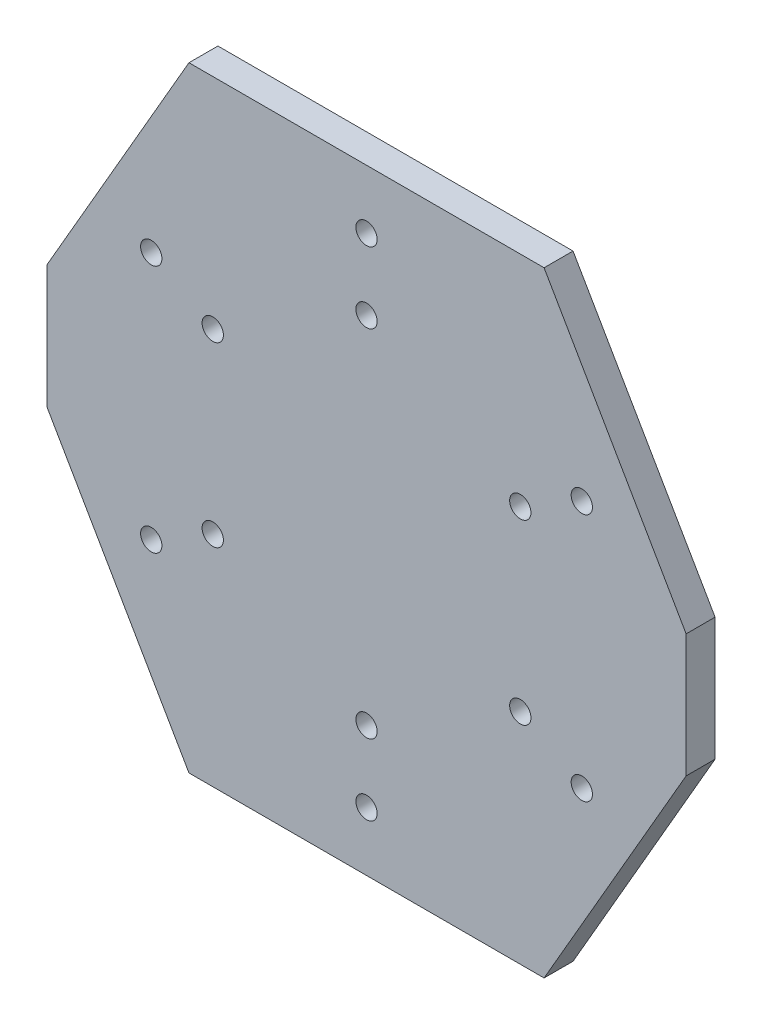
ISO-10303-21;
HEADER;
FILE_DESCRIPTION(('STEP AP214'),'2;1');
FILE_NAME('part.step','',(''),(''),'','','');
FILE_SCHEMA(('AUTOMOTIVE_DESIGN { 1 0 10303 214 1 1 1 1 }'));
ENDSEC;
DATA;
#1=APPLICATION_CONTEXT('core data for automotive mechanical design processes');
#2=APPLICATION_PROTOCOL_DEFINITION('international standard','automotive_design',2000,#1);
#3=PRODUCT_CONTEXT('',#1,'mechanical');
#4=PRODUCT('Part','Part','',(#3));
#5=PRODUCT_RELATED_PRODUCT_CATEGORY('part','',(#4));
#6=PRODUCT_DEFINITION_FORMATION('','',#4);
#7=PRODUCT_DEFINITION_CONTEXT('part definition',#1,'design');
#8=PRODUCT_DEFINITION('design','',#6,#7);
#9=PRODUCT_DEFINITION_SHAPE('','',#8);
#10=(LENGTH_UNIT() NAMED_UNIT(*) SI_UNIT(.MILLI.,.METRE.));
#11=(NAMED_UNIT(*) PLANE_ANGLE_UNIT() SI_UNIT($,.RADIAN.));
#12=(NAMED_UNIT(*) SI_UNIT($,.STERADIAN.) SOLID_ANGLE_UNIT());
#13=UNCERTAINTY_MEASURE_WITH_UNIT(LENGTH_MEASURE(1.E-05),#10,'distance_accuracy_value','');
#14=(GEOMETRIC_REPRESENTATION_CONTEXT(3) GLOBAL_UNCERTAINTY_ASSIGNED_CONTEXT((#13)) GLOBAL_UNIT_ASSIGNED_CONTEXT((#10,
#11,#12)) REPRESENTATION_CONTEXT('',''));
#15=CARTESIAN_POINT('',(0.,0.,0.));
#16=DIRECTION('',(0.,0.,1.));
#17=DIRECTION('',(1.,0.,0.));
#18=AXIS2_PLACEMENT_3D('',#15,#16,#17);
#19=CARTESIAN_POINT('',(-10.,-17.3209991455078,0.));
#20=DIRECTION('',(-0.866034664249877,-0.499983960060323,0.));
#21=DIRECTION('',(-0.499983960060323,0.866034664249877,0.));
#22=AXIS2_PLACEMENT_3D('',#19,#20,#21);
#23=PLANE('',#22);
#24=DIRECTION('',(0.,0.,1.));
#25=VECTOR('',#24,1.);
#26=CARTESIAN_POINT('',(-10.,-17.3209991455078,0.));
#27=LINE('',#26,#25);
#28=CARTESIAN_POINT('',(-10.,-17.3209991455078,0.));
#29=VERTEX_POINT('',#28);
#30=CARTESIAN_POINT('',(-10.,-17.3209991455078,1.63068254));
#31=VERTEX_POINT('',#30);
#32=EDGE_CURVE('E10',#29,#31,#27,.T.);
#33=ORIENTED_EDGE('',*,*,#32,.T.);
#34=DIRECTION('',(-0.499983960060323,0.866034664249877,0.));
#35=VECTOR('',#34,1.);
#36=CARTESIAN_POINT('',(-10.,-17.3209991455078,1.63068254));
#37=LINE('',#36,#35);
#38=CARTESIAN_POINT('',(-18.,-3.46399998664856,1.63068254));
#39=VERTEX_POINT('',#38);
#40=EDGE_CURVE('E23',#31,#39,#37,.T.);
#41=ORIENTED_EDGE('',*,*,#40,.T.);
#42=DIRECTION('',(0.,0.,1.));
#43=VECTOR('',#42,1.);
#44=CARTESIAN_POINT('',(-18.,-3.46399998664856,0.));
#45=LINE('',#44,#43);
#46=CARTESIAN_POINT('',(-18.,-3.46399998664856,0.));
#47=VERTEX_POINT('',#46);
#48=EDGE_CURVE('E306',#47,#39,#45,.T.);
#49=ORIENTED_EDGE('',*,*,#48,.F.);
#50=DIRECTION('',(-0.499983960060323,0.866034664249877,0.));
#51=VECTOR('',#50,1.);
#52=CARTESIAN_POINT('',(-10.,-17.3209991455078,0.));
#53=LINE('',#52,#51);
#54=EDGE_CURVE('E303',#29,#47,#53,.T.);
#55=ORIENTED_EDGE('',*,*,#54,.F.);
#56=EDGE_LOOP('',(#33,#41,#49,#55));
#57=FACE_BOUND('',#56,.T.);
#58=ADVANCED_FACE('F16',(#57),#23,.T.);
#59=CARTESIAN_POINT('',(-18.,-3.46399998664856,0.));
#60=DIRECTION('',(-1.,0.,0.));
#61=DIRECTION('',(0.,1.,0.));
#62=AXIS2_PLACEMENT_3D('',#59,#60,#61);
#63=PLANE('',#62);
#64=ORIENTED_EDGE('',*,*,#48,.T.);
#65=DIRECTION('',(0.,1.,0.));
#66=VECTOR('',#65,1.);
#67=CARTESIAN_POINT('',(-18.,-3.46399998664856,1.63068254));
#68=LINE('',#67,#66);
#69=CARTESIAN_POINT('',(-18.,3.46399998664856,1.63068254));
#70=VERTEX_POINT('',#69);
#71=EDGE_CURVE('E300',#39,#70,#68,.T.);
#72=ORIENTED_EDGE('',*,*,#71,.T.);
#73=DIRECTION('',(0.,0.,1.));
#74=VECTOR('',#73,1.);
#75=CARTESIAN_POINT('',(-18.,3.46399998664856,0.));
#76=LINE('',#75,#74);
#77=CARTESIAN_POINT('',(-18.,3.46399998664856,0.));
#78=VERTEX_POINT('',#77);
#79=EDGE_CURVE('E298',#78,#70,#76,.T.);
#80=ORIENTED_EDGE('',*,*,#79,.F.);
#81=DIRECTION('',(0.,1.,0.));
#82=VECTOR('',#81,1.);
#83=CARTESIAN_POINT('',(-18.,-3.46399998664856,0.));
#84=LINE('',#83,#82);
#85=EDGE_CURVE('E295',#47,#78,#84,.T.);
#86=ORIENTED_EDGE('',*,*,#85,.F.);
#87=EDGE_LOOP('',(#64,#72,#80,#86));
#88=FACE_BOUND('',#87,.T.);
#89=ADVANCED_FACE('F315',(#88),#63,.T.);
#90=CARTESIAN_POINT('',(-18.,3.46399998664856,0.));
#91=DIRECTION('',(-0.866034664249877,0.499983960060323,0.));
#92=DIRECTION('',(0.499983960060323,0.866034664249877,0.));
#93=AXIS2_PLACEMENT_3D('',#90,#91,#92);
#94=PLANE('',#93);
#95=ORIENTED_EDGE('',*,*,#79,.T.);
#96=DIRECTION('',(0.499983960060323,0.866034664249877,0.));
#97=VECTOR('',#96,1.);
#98=CARTESIAN_POINT('',(-18.,3.46399998664856,1.63068254));
#99=LINE('',#98,#97);
#100=CARTESIAN_POINT('',(-10.,17.3209991455078,1.63068254));
#101=VERTEX_POINT('',#100);
#102=EDGE_CURVE('E292',#70,#101,#99,.T.);
#103=ORIENTED_EDGE('',*,*,#102,.T.);
#104=DIRECTION('',(0.,0.,1.));
#105=VECTOR('',#104,1.);
#106=CARTESIAN_POINT('',(-10.,17.3209991455078,0.));
#107=LINE('',#106,#105);
#108=CARTESIAN_POINT('',(-10.,17.3209991455078,0.));
#109=VERTEX_POINT('',#108);
#110=EDGE_CURVE('E290',#109,#101,#107,.T.);
#111=ORIENTED_EDGE('',*,*,#110,.F.);
#112=DIRECTION('',(0.499983960060323,0.866034664249877,0.));
#113=VECTOR('',#112,1.);
#114=CARTESIAN_POINT('',(-18.,3.46399998664856,0.));
#115=LINE('',#114,#113);
#116=EDGE_CURVE('E287',#78,#109,#115,.T.);
#117=ORIENTED_EDGE('',*,*,#116,.F.);
#118=EDGE_LOOP('',(#95,#103,#111,#117));
#119=FACE_BOUND('',#118,.T.);
#120=ADVANCED_FACE('F322',(#119),#94,.T.);
#121=CARTESIAN_POINT('',(-10.,17.3209991455078,0.));
#122=DIRECTION('',(0.,1.,0.));
#123=DIRECTION('',(1.,0.,0.));
#124=AXIS2_PLACEMENT_3D('',#121,#122,#123);
#125=PLANE('',#124);
#126=ORIENTED_EDGE('',*,*,#110,.T.);
#127=DIRECTION('',(1.,0.,0.));
#128=VECTOR('',#127,1.);
#129=CARTESIAN_POINT('',(-10.,17.3209991455078,1.63068254));
#130=LINE('',#129,#128);
#131=CARTESIAN_POINT('',(10.,17.3209991455078,1.63068254));
#132=VERTEX_POINT('',#131);
#133=EDGE_CURVE('E284',#101,#132,#130,.T.);
#134=ORIENTED_EDGE('',*,*,#133,.T.);
#135=DIRECTION('',(0.,0.,1.));
#136=VECTOR('',#135,1.);
#137=CARTESIAN_POINT('',(10.,17.3209991455078,0.));
#138=LINE('',#137,#136);
#139=CARTESIAN_POINT('',(10.,17.3209991455078,0.));
#140=VERTEX_POINT('',#139);
#141=EDGE_CURVE('E282',#140,#132,#138,.T.);
#142=ORIENTED_EDGE('',*,*,#141,.F.);
#143=DIRECTION('',(1.,0.,0.));
#144=VECTOR('',#143,1.);
#145=CARTESIAN_POINT('',(-10.,17.3209991455078,0.));
#146=LINE('',#145,#144);
#147=EDGE_CURVE('E279',#109,#140,#146,.T.);
#148=ORIENTED_EDGE('',*,*,#147,.F.);
#149=EDGE_LOOP('',(#126,#134,#142,#148));
#150=FACE_BOUND('',#149,.T.);
#151=ADVANCED_FACE('F324',(#150),#125,.T.);
#152=CARTESIAN_POINT('',(10.,17.3209991455078,0.));
#153=DIRECTION('',(0.866034664249877,0.499983960060323,0.));
#154=DIRECTION('',(0.499983960060323,-0.866034664249877,0.));
#155=AXIS2_PLACEMENT_3D('',#152,#153,#154);
#156=PLANE('',#155);
#157=ORIENTED_EDGE('',*,*,#141,.T.);
#158=DIRECTION('',(0.499983960060323,-0.866034664249877,0.));
#159=VECTOR('',#158,1.);
#160=CARTESIAN_POINT('',(10.,17.3209991455078,1.63068254));
#161=LINE('',#160,#159);
#162=CARTESIAN_POINT('',(18.,3.46399998664856,1.63068254));
#163=VERTEX_POINT('',#162);
#164=EDGE_CURVE('E276',#132,#163,#161,.T.);
#165=ORIENTED_EDGE('',*,*,#164,.T.);
#166=DIRECTION('',(0.,0.,1.));
#167=VECTOR('',#166,1.);
#168=CARTESIAN_POINT('',(18.,3.46399998664856,0.));
#169=LINE('',#168,#167);
#170=CARTESIAN_POINT('',(18.,3.46399998664856,0.));
#171=VERTEX_POINT('',#170);
#172=EDGE_CURVE('E274',#171,#163,#169,.T.);
#173=ORIENTED_EDGE('',*,*,#172,.F.);
#174=DIRECTION('',(0.499983960060323,-0.866034664249877,0.));
#175=VECTOR('',#174,1.);
#176=CARTESIAN_POINT('',(10.,17.3209991455078,0.));
#177=LINE('',#176,#175);
#178=EDGE_CURVE('E271',#140,#171,#177,.T.);
#179=ORIENTED_EDGE('',*,*,#178,.F.);
#180=EDGE_LOOP('',(#157,#165,#173,#179));
#181=FACE_BOUND('',#180,.T.);
#182=ADVANCED_FACE('F329',(#181),#156,.T.);
#183=CARTESIAN_POINT('',(18.,3.46399998664856,0.));
#184=DIRECTION('',(1.,0.,0.));
#185=DIRECTION('',(0.,-1.,0.));
#186=AXIS2_PLACEMENT_3D('',#183,#184,#185);
#187=PLANE('',#186);
#188=ORIENTED_EDGE('',*,*,#172,.T.);
#189=DIRECTION('',(0.,-1.,0.));
#190=VECTOR('',#189,1.);
#191=CARTESIAN_POINT('',(18.,3.46399998664856,1.63068254));
#192=LINE('',#191,#190);
#193=CARTESIAN_POINT('',(18.,-3.46399998664856,1.63068254));
#194=VERTEX_POINT('',#193);
#195=EDGE_CURVE('E268',#163,#194,#192,.T.);
#196=ORIENTED_EDGE('',*,*,#195,.T.);
#197=DIRECTION('',(0.,0.,1.));
#198=VECTOR('',#197,1.);
#199=CARTESIAN_POINT('',(18.,-3.46399998664856,0.));
#200=LINE('',#199,#198);
#201=CARTESIAN_POINT('',(18.,-3.46399998664856,0.));
#202=VERTEX_POINT('',#201);
#203=EDGE_CURVE('E266',#202,#194,#200,.T.);
#204=ORIENTED_EDGE('',*,*,#203,.F.);
#205=DIRECTION('',(0.,-1.,0.));
#206=VECTOR('',#205,1.);
#207=CARTESIAN_POINT('',(18.,3.46399998664856,0.));
#208=LINE('',#207,#206);
#209=EDGE_CURVE('E263',#171,#202,#208,.T.);
#210=ORIENTED_EDGE('',*,*,#209,.F.);
#211=EDGE_LOOP('',(#188,#196,#204,#210));
#212=FACE_BOUND('',#211,.T.);
#213=ADVANCED_FACE('F332',(#212),#187,.T.);
#214=CARTESIAN_POINT('',(18.,-3.46399998664856,0.));
#215=DIRECTION('',(0.866034664249877,-0.499983960060323,0.));
#216=DIRECTION('',(-0.499983960060323,-0.866034664249877,0.));
#217=AXIS2_PLACEMENT_3D('',#214,#215,#216);
#218=PLANE('',#217);
#219=ORIENTED_EDGE('',*,*,#203,.T.);
#220=DIRECTION('',(-0.499983960060323,-0.866034664249877,0.));
#221=VECTOR('',#220,1.);
#222=CARTESIAN_POINT('',(18.,-3.46399998664856,1.63068254));
#223=LINE('',#222,#221);
#224=CARTESIAN_POINT('',(10.,-17.3209991455078,1.63068254));
#225=VERTEX_POINT('',#224);
#226=EDGE_CURVE('E260',#194,#225,#223,.T.);
#227=ORIENTED_EDGE('',*,*,#226,.T.);
#228=DIRECTION('',(0.,0.,1.));
#229=VECTOR('',#228,1.);
#230=CARTESIAN_POINT('',(10.,-17.3209991455078,0.));
#231=LINE('',#230,#229);
#232=CARTESIAN_POINT('',(10.,-17.3209991455078,0.));
#233=VERTEX_POINT('',#232);
#234=EDGE_CURVE('E258',#233,#225,#231,.T.);
#235=ORIENTED_EDGE('',*,*,#234,.F.);
#236=DIRECTION('',(-0.499983960060323,-0.866034664249877,0.));
#237=VECTOR('',#236,1.);
#238=CARTESIAN_POINT('',(18.,-3.46399998664856,0.));
#239=LINE('',#238,#237);
#240=EDGE_CURVE('E255',#202,#233,#239,.T.);
#241=ORIENTED_EDGE('',*,*,#240,.F.);
#242=EDGE_LOOP('',(#219,#227,#235,#241));
#243=FACE_BOUND('',#242,.T.);
#244=ADVANCED_FACE('F336',(#243),#218,.T.);
#245=CARTESIAN_POINT('',(10.,-17.3209991455078,0.));
#246=DIRECTION('',(0.,-1.,0.));
#247=DIRECTION('',(-1.,0.,0.));
#248=AXIS2_PLACEMENT_3D('',#245,#246,#247);
#249=PLANE('',#248);
#250=ORIENTED_EDGE('',*,*,#234,.T.);
#251=DIRECTION('',(-1.,0.,0.));
#252=VECTOR('',#251,1.);
#253=CARTESIAN_POINT('',(10.,-17.3209991455078,1.63068254));
#254=LINE('',#253,#252);
#255=EDGE_CURVE('E253',#225,#31,#254,.T.);
#256=ORIENTED_EDGE('',*,*,#255,.T.);
#257=ORIENTED_EDGE('',*,*,#32,.F.);
#258=DIRECTION('',(-1.,0.,0.));
#259=VECTOR('',#258,1.);
#260=CARTESIAN_POINT('',(10.,-17.3209991455078,0.));
#261=LINE('',#260,#259);
#262=EDGE_CURVE('E250',#233,#29,#261,.T.);
#263=ORIENTED_EDGE('',*,*,#262,.F.);
#264=EDGE_LOOP('',(#250,#256,#257,#263));
#265=FACE_BOUND('',#264,.T.);
#266=ADVANCED_FACE('F337',(#265),#249,.T.);
#267=CARTESIAN_POINT('',(-12.12435472,-7.00000124,0.));
#268=DIRECTION('',(0.,0.,-1.));
#269=DIRECTION('',(1.,0.,0.));
#270=AXIS2_PLACEMENT_3D('',#267,#268,#269);
#271=CYLINDRICAL_SURFACE('',#270,0.5999988);
#272=DIRECTION('',(0.,0.,1.));
#273=VECTOR('',#272,1.);
#274=CARTESIAN_POINT('',(-11.52435592,-7.00000124,0.));
#275=LINE('',#274,#273);
#276=CARTESIAN_POINT('',(-11.52435592,-7.00000124,0.));
#277=VERTEX_POINT('',#276);
#278=CARTESIAN_POINT('',(-11.52435592,-7.00000124,1.63068254));
#279=VERTEX_POINT('',#278);
#280=EDGE_CURVE('E248',#277,#279,#275,.T.);
#281=ORIENTED_EDGE('',*,*,#280,.T.);
#282=CARTESIAN_POINT('',(-12.12435472,-7.00000124,1.63068254));
#283=DIRECTION('',(0.,0.,1.));
#284=DIRECTION('',(1.,0.,0.));
#285=AXIS2_PLACEMENT_3D('',#282,#283,#284);
#286=CIRCLE('',#285,0.5999988);
#287=EDGE_CURVE('E245',#279,#279,#286,.T.);
#288=ORIENTED_EDGE('',*,*,#287,.T.);
#289=ORIENTED_EDGE('',*,*,#280,.F.);
#290=CARTESIAN_POINT('',(-12.12435472,-7.00000124,0.));
#291=DIRECTION('',(0.,0.,1.));
#292=DIRECTION('',(1.,0.,0.));
#293=AXIS2_PLACEMENT_3D('',#290,#291,#292);
#294=CIRCLE('',#293,0.5999988);
#295=EDGE_CURVE('E242',#277,#277,#294,.T.);
#296=ORIENTED_EDGE('',*,*,#295,.F.);
#297=EDGE_LOOP('',(#281,#288,#289,#296));
#298=FACE_BOUND('',#297,.T.);
#299=ADVANCED_FACE('F339',(#298),#271,.F.);
#300=CARTESIAN_POINT('',(-8.66025191999999,-5.00000016,0.));
#301=DIRECTION('',(0.,0.,-1.));
#302=DIRECTION('',(1.,0.,0.));
#303=AXIS2_PLACEMENT_3D('',#300,#301,#302);
#304=CYLINDRICAL_SURFACE('',#303,0.5999988);
#305=DIRECTION('',(0.,0.,1.));
#306=VECTOR('',#305,1.);
#307=CARTESIAN_POINT('',(-8.06025311999999,-5.00000016,0.));
#308=LINE('',#307,#306);
#309=CARTESIAN_POINT('',(-8.06025311999999,-5.00000016,0.));
#310=VERTEX_POINT('',#309);
#311=CARTESIAN_POINT('',(-8.06025311999999,-5.00000016,1.63068254));
#312=VERTEX_POINT('',#311);
#313=EDGE_CURVE('E240',#310,#312,#308,.T.);
#314=ORIENTED_EDGE('',*,*,#313,.T.);
#315=CARTESIAN_POINT('',(-8.66025191999999,-5.00000016,1.63068254));
#316=DIRECTION('',(0.,0.,1.));
#317=DIRECTION('',(1.,0.,0.));
#318=AXIS2_PLACEMENT_3D('',#315,#316,#317);
#319=CIRCLE('',#318,0.5999988);
#320=EDGE_CURVE('E237',#312,#312,#319,.T.);
#321=ORIENTED_EDGE('',*,*,#320,.T.);
#322=ORIENTED_EDGE('',*,*,#313,.F.);
#323=CARTESIAN_POINT('',(-8.66025191999999,-5.00000016,0.));
#324=DIRECTION('',(0.,0.,1.));
#325=DIRECTION('',(1.,0.,0.));
#326=AXIS2_PLACEMENT_3D('',#323,#324,#325);
#327=CIRCLE('',#326,0.5999988);
#328=EDGE_CURVE('E234',#310,#310,#327,.T.);
#329=ORIENTED_EDGE('',*,*,#328,.F.);
#330=EDGE_LOOP('',(#314,#321,#322,#329));
#331=FACE_BOUND('',#330,.T.);
#332=ADVANCED_FACE('F346',(#331),#304,.F.);
#333=CARTESIAN_POINT('',(-8.66025191999999,5.00000016,0.));
#334=DIRECTION('',(0.,0.,-1.));
#335=DIRECTION('',(1.,0.,0.));
#336=AXIS2_PLACEMENT_3D('',#333,#334,#335);
#337=CYLINDRICAL_SURFACE('',#336,0.5999988);
#338=DIRECTION('',(0.,0.,1.));
#339=VECTOR('',#338,1.);
#340=CARTESIAN_POINT('',(-8.06025311999999,5.00000016,0.));
#341=LINE('',#340,#339);
#342=CARTESIAN_POINT('',(-8.06025311999999,5.00000016,0.));
#343=VERTEX_POINT('',#342);
#344=CARTESIAN_POINT('',(-8.06025311999999,5.00000016,1.63068254));
#345=VERTEX_POINT('',#344);
#346=EDGE_CURVE('E232',#343,#345,#341,.T.);
#347=ORIENTED_EDGE('',*,*,#346,.T.);
#348=CARTESIAN_POINT('',(-8.66025191999999,5.00000016,1.63068254));
#349=DIRECTION('',(0.,0.,1.));
#350=DIRECTION('',(1.,0.,0.));
#351=AXIS2_PLACEMENT_3D('',#348,#349,#350);
#352=CIRCLE('',#351,0.5999988);
#353=EDGE_CURVE('E229',#345,#345,#352,.T.);
#354=ORIENTED_EDGE('',*,*,#353,.T.);
#355=ORIENTED_EDGE('',*,*,#346,.F.);
#356=CARTESIAN_POINT('',(-8.66025191999999,5.00000016,0.));
#357=DIRECTION('',(0.,0.,1.));
#358=DIRECTION('',(1.,0.,0.));
#359=AXIS2_PLACEMENT_3D('',#356,#357,#358);
#360=CIRCLE('',#359,0.5999988);
#361=EDGE_CURVE('E226',#343,#343,#360,.T.);
#362=ORIENTED_EDGE('',*,*,#361,.F.);
#363=EDGE_LOOP('',(#347,#354,#355,#362));
#364=FACE_BOUND('',#363,.T.);
#365=ADVANCED_FACE('F399',(#364),#337,.F.);
#366=CARTESIAN_POINT('',(-12.12435472,7.00000124,0.));
#367=DIRECTION('',(0.,0.,-1.));
#368=DIRECTION('',(1.,0.,0.));
#369=AXIS2_PLACEMENT_3D('',#366,#367,#368);
#370=CYLINDRICAL_SURFACE('',#369,0.5999988);
#371=DIRECTION('',(0.,0.,1.));
#372=VECTOR('',#371,1.);
#373=CARTESIAN_POINT('',(-11.52435592,7.00000124,0.));
#374=LINE('',#373,#372);
#375=CARTESIAN_POINT('',(-11.52435592,7.00000124,0.));
#376=VERTEX_POINT('',#375);
#377=CARTESIAN_POINT('',(-11.52435592,7.00000124,1.63068254));
#378=VERTEX_POINT('',#377);
#379=EDGE_CURVE('E224',#376,#378,#374,.T.);
#380=ORIENTED_EDGE('',*,*,#379,.T.);
#381=CARTESIAN_POINT('',(-12.12435472,7.00000124,1.63068254));
#382=DIRECTION('',(0.,0.,1.));
#383=DIRECTION('',(1.,0.,0.));
#384=AXIS2_PLACEMENT_3D('',#381,#382,#383);
#385=CIRCLE('',#384,0.5999988);
#386=EDGE_CURVE('E221',#378,#378,#385,.T.);
#387=ORIENTED_EDGE('',*,*,#386,.T.);
#388=ORIENTED_EDGE('',*,*,#379,.F.);
#389=CARTESIAN_POINT('',(-12.12435472,7.00000124,0.));
#390=DIRECTION('',(0.,0.,1.));
#391=DIRECTION('',(1.,0.,0.));
#392=AXIS2_PLACEMENT_3D('',#389,#390,#391);
#393=CIRCLE('',#392,0.5999988);
#394=EDGE_CURVE('E218',#376,#376,#393,.T.);
#395=ORIENTED_EDGE('',*,*,#394,.F.);
#396=EDGE_LOOP('',(#380,#387,#388,#395));
#397=FACE_BOUND('',#396,.T.);
#398=ADVANCED_FACE('F409',(#397),#370,.F.);
#399=CARTESIAN_POINT('',(0.,9.99999778,0.));
#400=DIRECTION('',(0.,0.,-1.));
#401=DIRECTION('',(1.,0.,0.));
#402=AXIS2_PLACEMENT_3D('',#399,#400,#401);
#403=CYLINDRICAL_SURFACE('',#402,0.5999988);
#404=DIRECTION('',(0.,0.,1.));
#405=VECTOR('',#404,1.);
#406=CARTESIAN_POINT('',(0.5999988,9.99999778,0.));
#407=LINE('',#406,#405);
#408=CARTESIAN_POINT('',(0.5999988,9.99999778,0.));
#409=VERTEX_POINT('',#408);
#410=CARTESIAN_POINT('',(0.5999988,9.99999778,1.63068254));
#411=VERTEX_POINT('',#410);
#412=EDGE_CURVE('E216',#409,#411,#407,.T.);
#413=ORIENTED_EDGE('',*,*,#412,.T.);
#414=CARTESIAN_POINT('',(0.,9.99999778,1.63068254));
#415=DIRECTION('',(0.,0.,1.));
#416=DIRECTION('',(1.,0.,0.));
#417=AXIS2_PLACEMENT_3D('',#414,#415,#416);
#418=CIRCLE('',#417,0.5999988);
#419=EDGE_CURVE('E213',#411,#411,#418,.T.);
#420=ORIENTED_EDGE('',*,*,#419,.T.);
#421=ORIENTED_EDGE('',*,*,#412,.F.);
#422=CARTESIAN_POINT('',(0.,9.99999778,0.));
#423=DIRECTION('',(0.,0.,1.));
#424=DIRECTION('',(1.,0.,0.));
#425=AXIS2_PLACEMENT_3D('',#422,#423,#424);
#426=CIRCLE('',#425,0.5999988);
#427=EDGE_CURVE('E210',#409,#409,#426,.T.);
#428=ORIENTED_EDGE('',*,*,#427,.F.);
#429=EDGE_LOOP('',(#413,#420,#421,#428));
#430=FACE_BOUND('',#429,.T.);
#431=ADVANCED_FACE('F419',(#430),#403,.F.);
#432=CARTESIAN_POINT('',(0.,13.99999994,0.));
#433=DIRECTION('',(0.,0.,-1.));
#434=DIRECTION('',(1.,0.,0.));
#435=AXIS2_PLACEMENT_3D('',#432,#433,#434);
#436=CYLINDRICAL_SURFACE('',#435,0.5999988);
#437=DIRECTION('',(0.,0.,1.));
#438=VECTOR('',#437,1.);
#439=CARTESIAN_POINT('',(0.5999988,13.99999994,0.));
#440=LINE('',#439,#438);
#441=CARTESIAN_POINT('',(0.5999988,13.99999994,0.));
#442=VERTEX_POINT('',#441);
#443=CARTESIAN_POINT('',(0.5999988,13.99999994,1.63068254));
#444=VERTEX_POINT('',#443);
#445=EDGE_CURVE('E208',#442,#444,#440,.T.);
#446=ORIENTED_EDGE('',*,*,#445,.T.);
#447=CARTESIAN_POINT('',(0.,13.99999994,1.63068254));
#448=DIRECTION('',(0.,0.,1.));
#449=DIRECTION('',(1.,0.,0.));
#450=AXIS2_PLACEMENT_3D('',#447,#448,#449);
#451=CIRCLE('',#450,0.5999988);
#452=EDGE_CURVE('E205',#444,#444,#451,.T.);
#453=ORIENTED_EDGE('',*,*,#452,.T.);
#454=ORIENTED_EDGE('',*,*,#445,.F.);
#455=CARTESIAN_POINT('',(0.,13.99999994,0.));
#456=DIRECTION('',(0.,0.,1.));
#457=DIRECTION('',(1.,0.,0.));
#458=AXIS2_PLACEMENT_3D('',#455,#456,#457);
#459=CIRCLE('',#458,0.5999988);
#460=EDGE_CURVE('E202',#442,#442,#459,.T.);
#461=ORIENTED_EDGE('',*,*,#460,.F.);
#462=EDGE_LOOP('',(#446,#453,#454,#461));
#463=FACE_BOUND('',#462,.T.);
#464=ADVANCED_FACE('F429',(#463),#436,.F.);
#465=CARTESIAN_POINT('',(0.,-13.99999994,0.));
#466=DIRECTION('',(0.,0.,-1.));
#467=DIRECTION('',(1.,0.,0.));
#468=AXIS2_PLACEMENT_3D('',#465,#466,#467);
#469=CYLINDRICAL_SURFACE('',#468,0.5999988);
#470=DIRECTION('',(0.,0.,1.));
#471=VECTOR('',#470,1.);
#472=CARTESIAN_POINT('',(0.5999988,-13.99999994,0.));
#473=LINE('',#472,#471);
#474=CARTESIAN_POINT('',(0.5999988,-13.99999994,0.));
#475=VERTEX_POINT('',#474);
#476=CARTESIAN_POINT('',(0.5999988,-13.99999994,1.63068254));
#477=VERTEX_POINT('',#476);
#478=EDGE_CURVE('E200',#475,#477,#473,.T.);
#479=ORIENTED_EDGE('',*,*,#478,.T.);
#480=CARTESIAN_POINT('',(0.,-13.99999994,1.63068254));
#481=DIRECTION('',(0.,0.,1.));
#482=DIRECTION('',(1.,0.,0.));
#483=AXIS2_PLACEMENT_3D('',#480,#481,#482);
#484=CIRCLE('',#483,0.5999988);
#485=EDGE_CURVE('E197',#477,#477,#484,.T.);
#486=ORIENTED_EDGE('',*,*,#485,.T.);
#487=ORIENTED_EDGE('',*,*,#478,.F.);
#488=CARTESIAN_POINT('',(0.,-13.99999994,0.));
#489=DIRECTION('',(0.,0.,1.));
#490=DIRECTION('',(1.,0.,0.));
#491=AXIS2_PLACEMENT_3D('',#488,#489,#490);
#492=CIRCLE('',#491,0.5999988);
#493=EDGE_CURVE('E194',#475,#475,#492,.T.);
#494=ORIENTED_EDGE('',*,*,#493,.F.);
#495=EDGE_LOOP('',(#479,#486,#487,#494));
#496=FACE_BOUND('',#495,.T.);
#497=ADVANCED_FACE('F439',(#496),#469,.F.);
#498=CARTESIAN_POINT('',(0.,-9.99999778,0.));
#499=DIRECTION('',(0.,0.,-1.));
#500=DIRECTION('',(1.,0.,0.));
#501=AXIS2_PLACEMENT_3D('',#498,#499,#500);
#502=CYLINDRICAL_SURFACE('',#501,0.5999988);
#503=DIRECTION('',(0.,0.,1.));
#504=VECTOR('',#503,1.);
#505=CARTESIAN_POINT('',(0.5999988,-9.99999778,0.));
#506=LINE('',#505,#504);
#507=CARTESIAN_POINT('',(0.5999988,-9.99999778,0.));
#508=VERTEX_POINT('',#507);
#509=CARTESIAN_POINT('',(0.5999988,-9.99999778,1.63068254));
#510=VERTEX_POINT('',#509);
#511=EDGE_CURVE('E192',#508,#510,#506,.T.);
#512=ORIENTED_EDGE('',*,*,#511,.T.);
#513=CARTESIAN_POINT('',(0.,-9.99999778,1.63068254));
#514=DIRECTION('',(0.,0.,1.));
#515=DIRECTION('',(1.,0.,0.));
#516=AXIS2_PLACEMENT_3D('',#513,#514,#515);
#517=CIRCLE('',#516,0.5999988);
#518=EDGE_CURVE('E189',#510,#510,#517,.T.);
#519=ORIENTED_EDGE('',*,*,#518,.T.);
#520=ORIENTED_EDGE('',*,*,#511,.F.);
#521=CARTESIAN_POINT('',(0.,-9.99999778,0.));
#522=DIRECTION('',(0.,0.,1.));
#523=DIRECTION('',(1.,0.,0.));
#524=AXIS2_PLACEMENT_3D('',#521,#522,#523);
#525=CIRCLE('',#524,0.5999988);
#526=EDGE_CURVE('E186',#508,#508,#525,.T.);
#527=ORIENTED_EDGE('',*,*,#526,.F.);
#528=EDGE_LOOP('',(#512,#519,#520,#527));
#529=FACE_BOUND('',#528,.T.);
#530=ADVANCED_FACE('F449',(#529),#502,.F.);
#531=CARTESIAN_POINT('',(12.12435472,-7.00000124,0.));
#532=DIRECTION('',(0.,0.,-1.));
#533=DIRECTION('',(1.,0.,0.));
#534=AXIS2_PLACEMENT_3D('',#531,#532,#533);
#535=CYLINDRICAL_SURFACE('',#534,0.5999988);
#536=DIRECTION('',(0.,0.,1.));
#537=VECTOR('',#536,1.);
#538=CARTESIAN_POINT('',(12.72435352,-7.00000124,0.));
#539=LINE('',#538,#537);
#540=CARTESIAN_POINT('',(12.72435352,-7.00000124,0.));
#541=VERTEX_POINT('',#540);
#542=CARTESIAN_POINT('',(12.72435352,-7.00000124,1.63068254));
#543=VERTEX_POINT('',#542);
#544=EDGE_CURVE('E184',#541,#543,#539,.T.);
#545=ORIENTED_EDGE('',*,*,#544,.T.);
#546=CARTESIAN_POINT('',(12.12435472,-7.00000124,1.63068254));
#547=DIRECTION('',(0.,0.,1.));
#548=DIRECTION('',(1.,0.,0.));
#549=AXIS2_PLACEMENT_3D('',#546,#547,#548);
#550=CIRCLE('',#549,0.5999988);
#551=EDGE_CURVE('E181',#543,#543,#550,.T.);
#552=ORIENTED_EDGE('',*,*,#551,.T.);
#553=ORIENTED_EDGE('',*,*,#544,.F.);
#554=CARTESIAN_POINT('',(12.12435472,-7.00000124,0.));
#555=DIRECTION('',(0.,0.,1.));
#556=DIRECTION('',(1.,0.,0.));
#557=AXIS2_PLACEMENT_3D('',#554,#555,#556);
#558=CIRCLE('',#557,0.5999988);
#559=EDGE_CURVE('E178',#541,#541,#558,.T.);
#560=ORIENTED_EDGE('',*,*,#559,.F.);
#561=EDGE_LOOP('',(#545,#552,#553,#560));
#562=FACE_BOUND('',#561,.T.);
#563=ADVANCED_FACE('F459',(#562),#535,.F.);
#564=CARTESIAN_POINT('',(8.66025192,-5.00000016,0.));
#565=DIRECTION('',(0.,0.,-1.));
#566=DIRECTION('',(1.,0.,0.));
#567=AXIS2_PLACEMENT_3D('',#564,#565,#566);
#568=CYLINDRICAL_SURFACE('',#567,0.5999988);
#569=DIRECTION('',(0.,0.,1.));
#570=VECTOR('',#569,1.);
#571=CARTESIAN_POINT('',(9.26025072,-5.00000016,0.));
#572=LINE('',#571,#570);
#573=CARTESIAN_POINT('',(9.26025072,-5.00000016,0.));
#574=VERTEX_POINT('',#573);
#575=CARTESIAN_POINT('',(9.26025072,-5.00000016,1.63068254));
#576=VERTEX_POINT('',#575);
#577=EDGE_CURVE('E176',#574,#576,#572,.T.);
#578=ORIENTED_EDGE('',*,*,#577,.T.);
#579=CARTESIAN_POINT('',(8.66025192,-5.00000016,1.63068254));
#580=DIRECTION('',(0.,0.,1.));
#581=DIRECTION('',(1.,0.,0.));
#582=AXIS2_PLACEMENT_3D('',#579,#580,#581);
#583=CIRCLE('',#582,0.5999988);
#584=EDGE_CURVE('E173',#576,#576,#583,.T.);
#585=ORIENTED_EDGE('',*,*,#584,.T.);
#586=ORIENTED_EDGE('',*,*,#577,.F.);
#587=CARTESIAN_POINT('',(8.66025192,-5.00000016,0.));
#588=DIRECTION('',(0.,0.,1.));
#589=DIRECTION('',(1.,0.,0.));
#590=AXIS2_PLACEMENT_3D('',#587,#588,#589);
#591=CIRCLE('',#590,0.5999988);
#592=EDGE_CURVE('E170',#574,#574,#591,.T.);
#593=ORIENTED_EDGE('',*,*,#592,.F.);
#594=EDGE_LOOP('',(#578,#585,#586,#593));
#595=FACE_BOUND('',#594,.T.);
#596=ADVANCED_FACE('F469',(#595),#568,.F.);
#597=CARTESIAN_POINT('',(8.66025192,5.00000016,0.));
#598=DIRECTION('',(0.,0.,-1.));
#599=DIRECTION('',(1.,0.,0.));
#600=AXIS2_PLACEMENT_3D('',#597,#598,#599);
#601=CYLINDRICAL_SURFACE('',#600,0.5999988);
#602=DIRECTION('',(0.,0.,1.));
#603=VECTOR('',#602,1.);
#604=CARTESIAN_POINT('',(9.26025072,5.00000016,0.));
#605=LINE('',#604,#603);
#606=CARTESIAN_POINT('',(9.26025072,5.00000016,0.));
#607=VERTEX_POINT('',#606);
#608=CARTESIAN_POINT('',(9.26025072,5.00000016,1.63068254));
#609=VERTEX_POINT('',#608);
#610=EDGE_CURVE('E168',#607,#609,#605,.T.);
#611=ORIENTED_EDGE('',*,*,#610,.T.);
#612=CARTESIAN_POINT('',(8.66025192,5.00000016,1.63068254));
#613=DIRECTION('',(0.,0.,1.));
#614=DIRECTION('',(1.,0.,0.));
#615=AXIS2_PLACEMENT_3D('',#612,#613,#614);
#616=CIRCLE('',#615,0.5999988);
#617=EDGE_CURVE('E165',#609,#609,#616,.T.);
#618=ORIENTED_EDGE('',*,*,#617,.T.);
#619=ORIENTED_EDGE('',*,*,#610,.F.);
#620=CARTESIAN_POINT('',(8.66025192,5.00000016,0.));
#621=DIRECTION('',(0.,0.,1.));
#622=DIRECTION('',(1.,0.,0.));
#623=AXIS2_PLACEMENT_3D('',#620,#621,#622);
#624=CIRCLE('',#623,0.5999988);
#625=EDGE_CURVE('E156',#607,#607,#624,.T.);
#626=ORIENTED_EDGE('',*,*,#625,.F.);
#627=EDGE_LOOP('',(#611,#618,#619,#626));
#628=FACE_BOUND('',#627,.T.);
#629=ADVANCED_FACE('F479',(#628),#601,.F.);
#630=CARTESIAN_POINT('',(12.12435472,7.00000124,0.));
#631=DIRECTION('',(0.,0.,-1.));
#632=DIRECTION('',(1.,0.,0.));
#633=AXIS2_PLACEMENT_3D('',#630,#631,#632);
#634=CYLINDRICAL_SURFACE('',#633,0.5999988);
#635=DIRECTION('',(0.,0.,1.));
#636=VECTOR('',#635,1.);
#637=CARTESIAN_POINT('',(12.72435352,7.00000124,0.));
#638=LINE('',#637,#636);
#639=CARTESIAN_POINT('',(12.72435352,7.00000124,0.));
#640=VERTEX_POINT('',#639);
#641=CARTESIAN_POINT('',(12.72435352,7.00000124,1.63068254));
#642=VERTEX_POINT('',#641);
#643=EDGE_CURVE('E150',#640,#642,#638,.T.);
#644=ORIENTED_EDGE('',*,*,#643,.T.);
#645=CARTESIAN_POINT('',(12.12435472,7.00000124,1.63068254));
#646=DIRECTION('',(0.,0.,1.));
#647=DIRECTION('',(1.,0.,0.));
#648=AXIS2_PLACEMENT_3D('',#645,#646,#647);
#649=CIRCLE('',#648,0.5999988);
#650=EDGE_CURVE('E155',#642,#642,#649,.T.);
#651=ORIENTED_EDGE('',*,*,#650,.T.);
#652=ORIENTED_EDGE('',*,*,#643,.F.);
#653=CARTESIAN_POINT('',(12.12435472,7.00000124,0.));
#654=DIRECTION('',(0.,0.,1.));
#655=DIRECTION('',(1.,0.,0.));
#656=AXIS2_PLACEMENT_3D('',#653,#654,#655);
#657=CIRCLE('',#656,0.5999988);
#658=EDGE_CURVE('E153',#640,#640,#657,.T.);
#659=ORIENTED_EDGE('',*,*,#658,.F.);
#660=EDGE_LOOP('',(#644,#651,#652,#659));
#661=FACE_BOUND('',#660,.T.);
#662=ADVANCED_FACE('F152',(#661),#634,.F.);
#663=CARTESIAN_POINT('',(-10.,-17.3209991455078,0.));
#664=DIRECTION('',(0.,0.,1.));
#665=DIRECTION('',(1.,0.,0.));
#666=AXIS2_PLACEMENT_3D('',#663,#664,#665);
#667=PLANE('',#666);
#668=ORIENTED_EDGE('',*,*,#54,.T.);
#669=ORIENTED_EDGE('',*,*,#85,.T.);
#670=ORIENTED_EDGE('',*,*,#116,.T.);
#671=ORIENTED_EDGE('',*,*,#147,.T.);
#672=ORIENTED_EDGE('',*,*,#178,.T.);
#673=ORIENTED_EDGE('',*,*,#209,.T.);
#674=ORIENTED_EDGE('',*,*,#240,.T.);
#675=ORIENTED_EDGE('',*,*,#262,.T.);
#676=EDGE_LOOP('',(#668,#669,#670,#671,#672,#673,#674,#675));
#677=FACE_BOUND('',#676,.T.);
#678=ORIENTED_EDGE('',*,*,#295,.T.);
#679=EDGE_LOOP('',(#678));
#680=FACE_BOUND('',#679,.T.);
#681=ORIENTED_EDGE('',*,*,#328,.T.);
#682=EDGE_LOOP('',(#681));
#683=FACE_BOUND('',#682,.T.);
#684=ORIENTED_EDGE('',*,*,#361,.T.);
#685=EDGE_LOOP('',(#684));
#686=FACE_BOUND('',#685,.T.);
#687=ORIENTED_EDGE('',*,*,#394,.T.);
#688=EDGE_LOOP('',(#687));
#689=FACE_BOUND('',#688,.T.);
#690=ORIENTED_EDGE('',*,*,#427,.T.);
#691=EDGE_LOOP('',(#690));
#692=FACE_BOUND('',#691,.T.);
#693=ORIENTED_EDGE('',*,*,#460,.T.);
#694=EDGE_LOOP('',(#693));
#695=FACE_BOUND('',#694,.T.);
#696=ORIENTED_EDGE('',*,*,#493,.T.);
#697=EDGE_LOOP('',(#696));
#698=FACE_BOUND('',#697,.T.);
#699=ORIENTED_EDGE('',*,*,#526,.T.);
#700=EDGE_LOOP('',(#699));
#701=FACE_BOUND('',#700,.T.);
#702=ORIENTED_EDGE('',*,*,#559,.T.);
#703=EDGE_LOOP('',(#702));
#704=FACE_BOUND('',#703,.T.);
#705=ORIENTED_EDGE('',*,*,#592,.T.);
#706=EDGE_LOOP('',(#705));
#707=FACE_BOUND('',#706,.T.);
#708=ORIENTED_EDGE('',*,*,#625,.T.);
#709=EDGE_LOOP('',(#708));
#710=FACE_BOUND('',#709,.T.);
#711=ORIENTED_EDGE('',*,*,#658,.T.);
#712=EDGE_LOOP('',(#711));
#713=FACE_BOUND('',#712,.T.);
#714=ADVANCED_FACE('F159',(#677,#680,#683,#686,#689,#692,#695,#698,#701,#704,#707,#710,#713),
#667,.F.);
#715=CARTESIAN_POINT('',(-10.,-17.3209991455078,1.63068254));
#716=DIRECTION('',(0.,0.,1.));
#717=DIRECTION('',(1.,0.,0.));
#718=AXIS2_PLACEMENT_3D('',#715,#716,#717);
#719=PLANE('',#718);
#720=ORIENTED_EDGE('',*,*,#255,.F.);
#721=ORIENTED_EDGE('',*,*,#226,.F.);
#722=ORIENTED_EDGE('',*,*,#195,.F.);
#723=ORIENTED_EDGE('',*,*,#164,.F.);
#724=ORIENTED_EDGE('',*,*,#133,.F.);
#725=ORIENTED_EDGE('',*,*,#102,.F.);
#726=ORIENTED_EDGE('',*,*,#71,.F.);
#727=ORIENTED_EDGE('',*,*,#40,.F.);
#728=EDGE_LOOP('',(#720,#721,#722,#723,#724,#725,#726,#727));
#729=FACE_BOUND('',#728,.T.);
#730=ORIENTED_EDGE('',*,*,#287,.F.);
#731=EDGE_LOOP('',(#730));
#732=FACE_BOUND('',#731,.T.);
#733=ORIENTED_EDGE('',*,*,#320,.F.);
#734=EDGE_LOOP('',(#733));
#735=FACE_BOUND('',#734,.T.);
#736=ORIENTED_EDGE('',*,*,#353,.F.);
#737=EDGE_LOOP('',(#736));
#738=FACE_BOUND('',#737,.T.);
#739=ORIENTED_EDGE('',*,*,#386,.F.);
#740=EDGE_LOOP('',(#739));
#741=FACE_BOUND('',#740,.T.);
#742=ORIENTED_EDGE('',*,*,#419,.F.);
#743=EDGE_LOOP('',(#742));
#744=FACE_BOUND('',#743,.T.);
#745=ORIENTED_EDGE('',*,*,#452,.F.);
#746=EDGE_LOOP('',(#745));
#747=FACE_BOUND('',#746,.T.);
#748=ORIENTED_EDGE('',*,*,#485,.F.);
#749=EDGE_LOOP('',(#748));
#750=FACE_BOUND('',#749,.T.);
#751=ORIENTED_EDGE('',*,*,#518,.F.);
#752=EDGE_LOOP('',(#751));
#753=FACE_BOUND('',#752,.T.);
#754=ORIENTED_EDGE('',*,*,#551,.F.);
#755=EDGE_LOOP('',(#754));
#756=FACE_BOUND('',#755,.T.);
#757=ORIENTED_EDGE('',*,*,#584,.F.);
#758=EDGE_LOOP('',(#757));
#759=FACE_BOUND('',#758,.T.);
#760=ORIENTED_EDGE('',*,*,#617,.F.);
#761=EDGE_LOOP('',(#760));
#762=FACE_BOUND('',#761,.T.);
#763=ORIENTED_EDGE('',*,*,#650,.F.);
#764=EDGE_LOOP('',(#763));
#765=FACE_BOUND('',#764,.T.);
#766=ADVANCED_FACE('F311',(#729,#732,#735,#738,#741,#744,#747,#750,#753,#756,#759,#762,#765),
#719,.T.);
#767=CLOSED_SHELL('',(#58,#89,#120,#151,#182,#213,#244,#266,#299,#332,#365,#398,#431,#464,#497,
#530,#563,#596,#629,#662,#714,#766));
#768=MANIFOLD_SOLID_BREP('B1',#767);
#769=ADVANCED_BREP_SHAPE_REPRESENTATION('',(#18,#768),#14);
#770=SHAPE_DEFINITION_REPRESENTATION(#9,#769);
ENDSEC;
END-ISO-10303-21;
